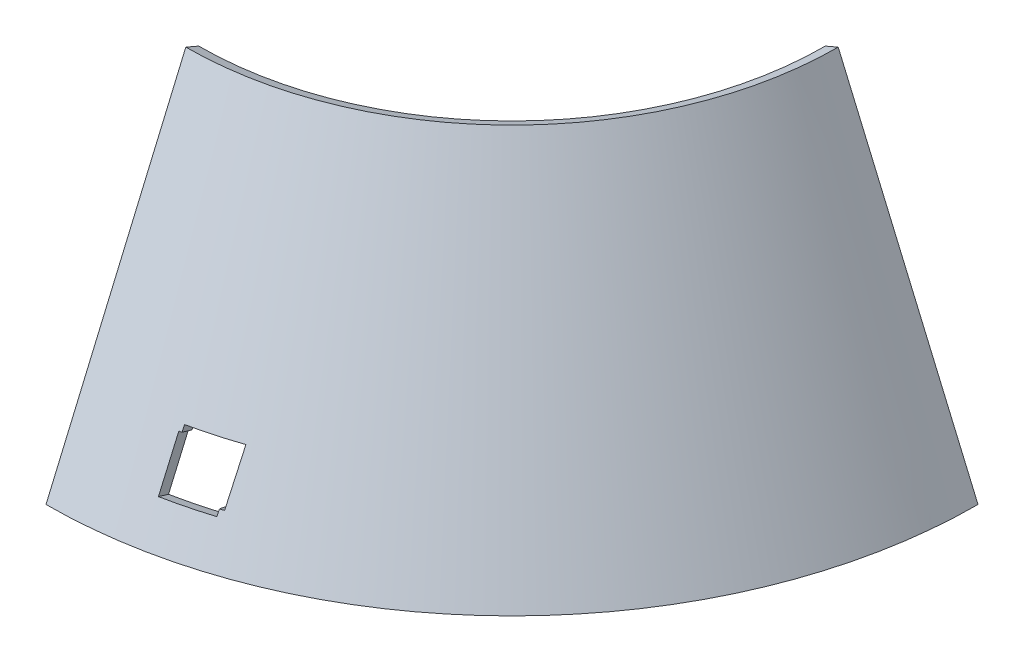
ISO-10303-21;
HEADER;
FILE_DESCRIPTION(('STEP AP214'),'2;1');
FILE_NAME('part.step','',(''),(''),'','','');
FILE_SCHEMA(('AUTOMOTIVE_DESIGN { 1 0 10303 214 1 1 1 1 }'));
ENDSEC;
DATA;
#1=APPLICATION_CONTEXT('core data for automotive mechanical design processes');
#2=APPLICATION_PROTOCOL_DEFINITION('international standard','automotive_design',2000,#1);
#3=PRODUCT_CONTEXT('',#1,'mechanical');
#4=PRODUCT('Part','Part','',(#3));
#5=PRODUCT_RELATED_PRODUCT_CATEGORY('part','',(#4));
#6=PRODUCT_DEFINITION_FORMATION('','',#4);
#7=PRODUCT_DEFINITION_CONTEXT('part definition',#1,'design');
#8=PRODUCT_DEFINITION('design','',#6,#7);
#9=PRODUCT_DEFINITION_SHAPE('','',#8);
#10=(LENGTH_UNIT() NAMED_UNIT(*) SI_UNIT(.MILLI.,.METRE.));
#11=(NAMED_UNIT(*) PLANE_ANGLE_UNIT() SI_UNIT($,.RADIAN.));
#12=(NAMED_UNIT(*) SI_UNIT($,.STERADIAN.) SOLID_ANGLE_UNIT());
#13=UNCERTAINTY_MEASURE_WITH_UNIT(LENGTH_MEASURE(1.E-05),#10,'distance_accuracy_value','');
#14=(GEOMETRIC_REPRESENTATION_CONTEXT(3) GLOBAL_UNCERTAINTY_ASSIGNED_CONTEXT((#13)) GLOBAL_UNIT_ASSIGNED_CONTEXT((#10,
#11,#12)) REPRESENTATION_CONTEXT('',''));
#15=CARTESIAN_POINT('',(0.,0.,0.));
#16=DIRECTION('',(0.,0.,1.));
#17=DIRECTION('',(1.,0.,0.));
#18=AXIS2_PLACEMENT_3D('',#15,#16,#17);
#19=CARTESIAN_POINT('',(0.,0.,0.));
#20=DIRECTION('',(0.,1.,0.));
#21=DIRECTION('',(-1.,0.,0.));
#22=AXIS2_PLACEMENT_3D('',#19,#20,#21);
#23=CONICAL_SURFACE('',#22,50.,1.16590454050981);
#24=DIRECTION('',(-0.919145030018058,-0.393919298579167,0.));
#25=VECTOR('',#24,1.);
#26=CARTESIAN_POINT('',(50.,0.,0.));
#27=LINE('',#26,#25);
#28=CARTESIAN_POINT('',(50.,0.,0.));
#29=VERTEX_POINT('',#28);
#30=CARTESIAN_POINT('',(48.6212824549729,-0.590878947868689,0.));
#31=VERTEX_POINT('',#30);
#32=EDGE_CURVE('E12',#29,#31,#27,.T.);
#33=ORIENTED_EDGE('',*,*,#32,.F.);
#34=CARTESIAN_POINT('',(0.,0.,0.));
#35=DIRECTION('',(0.,1.,0.));
#36=DIRECTION('',(-1.,0.,0.));
#37=AXIS2_PLACEMENT_3D('',#34,#35,#36);
#38=CIRCLE('',#37,50.);
#39=CARTESIAN_POINT('',(0.,0.,50.));
#40=VERTEX_POINT('',#39);
#41=EDGE_CURVE('E584',#40,#29,#38,.T.);
#42=ORIENTED_EDGE('',*,*,#41,.F.);
#43=DIRECTION('',(0.,-0.393919298579167,-0.919145030018058));
#44=VECTOR('',#43,1.);
#45=CARTESIAN_POINT('',(0.,0.,50.));
#46=LINE('',#45,#44);
#47=CARTESIAN_POINT('',(0.,-0.5908789478688,48.6212824549729));
#48=VERTEX_POINT('',#47);
#49=EDGE_CURVE('E115',#40,#48,#46,.T.);
#50=ORIENTED_EDGE('',*,*,#49,.T.);
#51=CARTESIAN_POINT('',(0.,-0.5908789478688,0.));
#52=DIRECTION('',(0.,-1.,0.));
#53=DIRECTION('',(1.,0.,0.));
#54=AXIS2_PLACEMENT_3D('',#51,#52,#53);
#55=CIRCLE('',#54,48.6212824549729);
#56=EDGE_CURVE('E582',#48,#31,#55,.F.);
#57=ORIENTED_EDGE('',*,*,#56,.T.);
#58=EDGE_LOOP('',(#33,#42,#50,#57));
#59=FACE_BOUND('',#58,.T.);
#60=ADVANCED_FACE('F105',(#59),#23,.T.);
#61=CARTESIAN_POINT('',(0.,35.,35.));
#62=DIRECTION('',(-1.,0.,0.));
#63=DIRECTION('',(0.,-0.919145030018058,0.393919298579168));
#64=AXIS2_PLACEMENT_3D('',#61,#62,#63);
#65=PLANE('',#64);
#66=ORIENTED_EDGE('',*,*,#49,.F.);
#67=DIRECTION('',(0.,-0.919145030018058,0.393919298579168));
#68=VECTOR('',#67,1.);
#69=CARTESIAN_POINT('',(0.,35.,35.));
#70=LINE('',#69,#68);
#71=CARTESIAN_POINT('',(0.,35.,35.));
#72=VERTEX_POINT('',#71);
#73=EDGE_CURVE('E595',#72,#40,#70,.T.);
#74=ORIENTED_EDGE('',*,*,#73,.F.);
#75=DIRECTION('',(0.,-0.393919298579167,-0.919145030018058));
#76=VECTOR('',#75,1.);
#77=CARTESIAN_POINT('',(0.,35.,35.));
#78=LINE('',#77,#76);
#79=CARTESIAN_POINT('',(0.,34.4091210521312,33.6212824549729));
#80=VERTEX_POINT('',#79);
#81=EDGE_CURVE('E560',#72,#80,#78,.T.);
#82=ORIENTED_EDGE('',*,*,#81,.T.);
#83=DIRECTION('',(0.,-0.919145030018058,0.393919298579167));
#84=VECTOR('',#83,1.);
#85=CARTESIAN_POINT('',(0.,-722.950151972001,358.203828036744));
#86=LINE('',#85,#84);
#87=EDGE_CURVE('E210',#80,#48,#86,.T.);
#88=ORIENTED_EDGE('',*,*,#87,.T.);
#89=EDGE_LOOP('',(#66,#74,#82,#88));
#90=FACE_BOUND('',#89,.T.);
#91=ADVANCED_FACE('F590',(#90),#65,.T.);
#92=CARTESIAN_POINT('',(0.,35.,0.));
#93=DIRECTION('',(0.,1.,0.));
#94=DIRECTION('',(-1.,0.,0.));
#95=AXIS2_PLACEMENT_3D('',#92,#93,#94);
#96=CONICAL_SURFACE('',#95,35.,1.16590454050981);
#97=ORIENTED_EDGE('',*,*,#81,.F.);
#98=CARTESIAN_POINT('',(0.,35.,0.));
#99=DIRECTION('',(0.,-1.,0.));
#100=DIRECTION('',(1.,0.,0.));
#101=AXIS2_PLACEMENT_3D('',#98,#99,#100);
#102=CIRCLE('',#101,35.);
#103=CARTESIAN_POINT('',(35.,35.,0.));
#104=VERTEX_POINT('',#103);
#105=EDGE_CURVE('E482',#104,#72,#102,.T.);
#106=ORIENTED_EDGE('',*,*,#105,.F.);
#107=DIRECTION('',(-0.919145030018058,-0.393919298579167,0.));
#108=VECTOR('',#107,1.);
#109=CARTESIAN_POINT('',(35.,35.,0.));
#110=LINE('',#109,#108);
#111=CARTESIAN_POINT('',(33.6212824549729,34.4091210521313,0.));
#112=VERTEX_POINT('',#111);
#113=EDGE_CURVE('E109',#104,#112,#110,.T.);
#114=ORIENTED_EDGE('',*,*,#113,.T.);
#115=CARTESIAN_POINT('',(0.,34.4091210521312,0.));
#116=DIRECTION('',(0.,-1.,0.));
#117=DIRECTION('',(1.,0.,0.));
#118=AXIS2_PLACEMENT_3D('',#115,#116,#117);
#119=CIRCLE('',#118,33.6212824549729);
#120=EDGE_CURVE('E475',#112,#80,#119,.T.);
#121=ORIENTED_EDGE('',*,*,#120,.T.);
#122=EDGE_LOOP('',(#97,#106,#114,#121));
#123=FACE_BOUND('',#122,.T.);
#124=ADVANCED_FACE('F430',(#123),#96,.F.);
#125=CARTESIAN_POINT('',(14.3892419399736,4.67901168580253,45.7869177279484));
#126=CARTESIAN_POINT('',(14.3893812829383,4.48205203651404,45.8753554285286));
#127=CARTESIAN_POINT('',(14.3893813113343,4.28509238722455,45.96381411015));
#128=CARTESIAN_POINT('',(14.3892419565247,4.08813273793385,46.0522934335054));
#129=CARTESIAN_POINT('',(13.9758901222228,4.08813273793378,44.4716221932006));
#130=CARTESIAN_POINT('',(13.9767524498923,3.89117308864523,44.559832684736));
#131=CARTESIAN_POINT('',(13.9774756503298,3.6942134393558,44.6480647534225));
#132=CARTESIAN_POINT('',(13.978059653915,3.49725379006509,44.7363180602608));
#133=B_SPLINE_SURFACE_WITH_KNOTS('',1,3,((#125,#126,#127,#128),(#129,#130,#131,#132)),
.UNSPECIFIED.,.F.,.F.,.F.,(2,2),(4,4),(0.,1.),(0.,1.),.UNSPECIFIED.);
#134=CARTESIAN_POINT('',(13.978059653915,3.49725379006509,44.7363180602608));
#135=CARTESIAN_POINT('',(14.3892419565247,4.08813273793385,46.0522934335054));
#136=B_SPLINE_CURVE_WITH_KNOTS('',1,(#134,#135),.UNSPECIFIED.,.F.,.F.,(2,2),(0.,1.),.UNSPECIFIED.);
#137=CARTESIAN_POINT('',(14.3892419565247,4.08813273793385,46.0522934335054));
#138=VERTEX_POINT('',#137);
#139=CARTESIAN_POINT('',(13.978059653915,3.49725379006507,44.7363180602608));
#140=VERTEX_POINT('',#139);
#141=EDGE_CURVE('E177',#138,#140,#136,.F.);
#142=CARTESIAN_POINT('',(14.3892419565247,4.08813273793385,46.0522934335054));
#143=CARTESIAN_POINT('',(14.3893813113343,4.28509238722455,45.96381411015));
#144=CARTESIAN_POINT('',(14.3893812829383,4.48205203651404,45.8753554285286));
#145=CARTESIAN_POINT('',(14.3892419399736,4.67901168580253,45.7869177279484));
#146=B_SPLINE_CURVE_WITH_KNOTS('',3,(#142,#143,#144,#145),.UNSPECIFIED.,.F.,.F.,(4,4),(0.,1.),.UNSPECIFIED.);
#147=CARTESIAN_POINT('',(14.3892419399736,4.6790116858026,45.7869177279484));
#148=VERTEX_POINT('',#147);
#149=EDGE_CURVE('E201',#148,#138,#146,.F.);
#150=CARTESIAN_POINT('',(14.3892419399736,4.67901168580253,45.7869177279484));
#151=CARTESIAN_POINT('',(13.9758901222228,4.08813273793378,44.4716221932006));
#152=B_SPLINE_CURVE_WITH_KNOTS('',1,(#150,#151),.UNSPECIFIED.,.F.,.F.,(2,2),(0.,1.),.UNSPECIFIED.);
#153=CARTESIAN_POINT('',(13.9758901222228,4.08813273793383,44.4716221932005));
#154=VERTEX_POINT('',#153);
#155=EDGE_CURVE('E413',#148,#154,#152,.T.);
#156=CARTESIAN_POINT('',(13.9758901222228,4.08813273793378,44.4716221932006));
#157=CARTESIAN_POINT('',(13.9767524498923,3.89117308864523,44.559832684736));
#158=CARTESIAN_POINT('',(13.9774756503298,3.6942134393558,44.6480647534225));
#159=CARTESIAN_POINT('',(13.978059653915,3.49725379006509,44.7363180602608));
#160=B_SPLINE_CURVE_WITH_KNOTS('',3,(#156,#157,#158,#159),.UNSPECIFIED.,.F.,.F.,(4,4),(0.,1.),.UNSPECIFIED.);
#161=EDGE_CURVE('E524',#154,#140,#160,.T.);
#162=ORIENTED_EDGE('',*,*,#141,.F.);
#163=ORIENTED_EDGE('',*,*,#149,.F.);
#164=ORIENTED_EDGE('',*,*,#155,.T.);
#165=ORIENTED_EDGE('',*,*,#161,.T.);
#166=EDGE_LOOP('',(#162,#163,#164,#165));
#167=FACE_BOUND('',#166,.T.);
#168=ADVANCED_FACE('F419',(#167),#133,.T.);
#169=CARTESIAN_POINT('',(0.,4.67901168580261,0.));
#170=DIRECTION('',(0.,1.,0.));
#171=DIRECTION('',(-1.,0.,0.));
#172=AXIS2_PLACEMENT_3D('',#169,#170,#171);
#173=CONICAL_SURFACE('',#172,47.9947092775132,1.16590454050981);
#174=ORIENTED_EDGE('',*,*,#155,.F.);
#175=CARTESIAN_POINT('',(0.,4.67901168580261,0.));
#176=DIRECTION('',(0.,-1.,0.));
#177=DIRECTION('',(1.,0.,0.));
#178=AXIS2_PLACEMENT_3D('',#175,#176,#177);
#179=CIRCLE('',#178,47.9947092775132);
#180=CARTESIAN_POINT('',(14.8148190944937,4.67901168580253,45.650994007036));
#181=VERTEX_POINT('',#180);
#182=EDGE_CURVE('E326',#181,#148,#179,.T.);
#183=ORIENTED_EDGE('',*,*,#182,.F.);
#184=CARTESIAN_POINT('',(14.3892419565247,4.08813273793378,44.3396030780588));
#185=CARTESIAN_POINT('',(14.8148190944937,4.67901168580253,45.650994007036));
#186=B_SPLINE_CURVE_WITH_KNOTS('',1,(#184,#185),.UNSPECIFIED.,.F.,.F.,(2,2),(0.,1.),.UNSPECIFIED.);
#187=CARTESIAN_POINT('',(14.3892419565247,4.08813273793378,44.3396030780588));
#188=VERTEX_POINT('',#187);
#189=EDGE_CURVE('E393',#181,#188,#186,.F.);
#190=ORIENTED_EDGE('',*,*,#189,.T.);
#191=CARTESIAN_POINT('',(0.,4.08813273793374,0.));
#192=DIRECTION('',(0.,-1.,0.));
#193=DIRECTION('',(1.,0.,0.));
#194=AXIS2_PLACEMENT_3D('',#191,#192,#193);
#195=CIRCLE('',#194,46.6159917324861);
#196=EDGE_CURVE('E518',#188,#154,#195,.T.);
#197=ORIENTED_EDGE('',*,*,#196,.T.);
#198=EDGE_LOOP('',(#174,#183,#190,#197));
#199=FACE_BOUND('',#198,.T.);
#200=ADVANCED_FACE('F351',(#199),#173,.F.);
#201=CARTESIAN_POINT('',(14.8353247552336,9.67901168580254,43.3855446385673));
#202=CARTESIAN_POINT('',(14.8397114872505,8.01234502431153,44.1389348409915));
#203=CARTESIAN_POINT('',(14.8328944856538,6.34567836530088,44.8941710754929));
#204=CARTESIAN_POINT('',(14.8148190944937,4.67901168580253,45.650994007036));
#205=CARTESIAN_POINT('',(14.3892419565247,9.08813273793379,42.0809863969922));
#206=CARTESIAN_POINT('',(14.4004459159958,7.42146607618486,42.8320455055236));
#207=CARTESIAN_POINT('',(14.4004644145953,5.75479941717914,43.5850040842722));
#208=CARTESIAN_POINT('',(14.3892419565247,4.08813273793378,44.3396030780588));
#209=B_SPLINE_SURFACE_WITH_KNOTS('',1,3,((#201,#202,#203,#204),(#205,#206,#207,#208)),
.UNSPECIFIED.,.F.,.F.,.F.,(2,2),(4,4),(0.,1.),(0.,1.),.UNSPECIFIED.);
#210=CARTESIAN_POINT('',(14.8148190944937,4.67901168580253,45.650994007036));
#211=CARTESIAN_POINT('',(14.8328944856538,6.34567836530088,44.8941710754929));
#212=CARTESIAN_POINT('',(14.8397114872505,8.01234502431153,44.1389348409915));
#213=CARTESIAN_POINT('',(14.8353247552336,9.67901168580254,43.3855446385673));
#214=B_SPLINE_CURVE_WITH_KNOTS('',3,(#210,#211,#212,#213),.UNSPECIFIED.,.F.,.F.,(4,4),(0.,1.),.UNSPECIFIED.);
#215=CARTESIAN_POINT('',(14.8353247552336,9.67901168580252,43.3855446385672));
#216=VERTEX_POINT('',#215);
#217=EDGE_CURVE('E322',#216,#181,#214,.F.);
#218=CARTESIAN_POINT('',(14.8353247552336,9.67901168580254,43.3855446385673));
#219=CARTESIAN_POINT('',(14.3892419565247,9.08813273793379,42.0809863969922));
#220=B_SPLINE_CURVE_WITH_KNOTS('',1,(#218,#219),.UNSPECIFIED.,.F.,.F.,(2,2),(0.,1.),.UNSPECIFIED.);
#221=CARTESIAN_POINT('',(14.3892419565247,9.08813273793379,42.0809863969922));
#222=VERTEX_POINT('',#221);
#223=EDGE_CURVE('E380',#216,#222,#220,.T.);
#224=CARTESIAN_POINT('',(14.3892419565247,9.08813273793379,42.0809863969922));
#225=CARTESIAN_POINT('',(14.4004459159958,7.42146607618486,42.8320455055236));
#226=CARTESIAN_POINT('',(14.4004644145953,5.75479941717914,43.5850040842722));
#227=CARTESIAN_POINT('',(14.3892419565247,4.08813273793378,44.3396030780588));
#228=B_SPLINE_CURVE_WITH_KNOTS('',3,(#224,#225,#226,#227),.UNSPECIFIED.,.F.,.F.,(4,4),(0.,1.),.UNSPECIFIED.);
#229=EDGE_CURVE('E335',#222,#188,#228,.T.);
#230=ORIENTED_EDGE('',*,*,#189,.F.);
#231=ORIENTED_EDGE('',*,*,#217,.F.);
#232=ORIENTED_EDGE('',*,*,#223,.T.);
#233=ORIENTED_EDGE('',*,*,#229,.T.);
#234=EDGE_LOOP('',(#230,#231,#232,#233));
#235=FACE_BOUND('',#234,.T.);
#236=ADVANCED_FACE('F340',(#235),#209,.T.);
#237=CARTESIAN_POINT('',(0.,9.67901168580252,0.));
#238=DIRECTION('',(0.,1.,0.));
#239=DIRECTION('',(-1.,0.,0.));
#240=AXIS2_PLACEMENT_3D('',#237,#238,#239);
#241=CONICAL_SURFACE('',#240,45.851852134656,1.16590454050981);
#242=ORIENTED_EDGE('',*,*,#223,.F.);
#243=CARTESIAN_POINT('',(0.,9.67901168580252,0.));
#244=DIRECTION('',(0.,1.,0.));
#245=DIRECTION('',(-1.,0.,0.));
#246=AXIS2_PLACEMENT_3D('',#243,#244,#245);
#247=CIRCLE('',#246,45.851852134656);
#248=CARTESIAN_POINT('',(9.6803190919552,9.67901168580254,44.8183418530438));
#249=VERTEX_POINT('',#248);
#250=EDGE_CURVE('E533',#249,#216,#247,.T.);
#251=ORIENTED_EDGE('',*,*,#250,.F.);
#252=CARTESIAN_POINT('',(9.38924195652468,9.08813273793379,43.470700888174));
#253=CARTESIAN_POINT('',(9.6803190919552,9.67901168580254,44.8183418530438));
#254=B_SPLINE_CURVE_WITH_KNOTS('',1,(#252,#253),.UNSPECIFIED.,.F.,.F.,(2,2),(0.,1.),.UNSPECIFIED.);
#255=CARTESIAN_POINT('',(9.38924195652467,9.08813273793377,43.470700888174));
#256=VERTEX_POINT('',#255);
#257=EDGE_CURVE('E537',#249,#256,#254,.F.);
#258=ORIENTED_EDGE('',*,*,#257,.T.);
#259=CARTESIAN_POINT('',(0.,9.08813273793374,0.));
#260=DIRECTION('',(0.,-1.,0.));
#261=DIRECTION('',(1.,0.,0.));
#262=AXIS2_PLACEMENT_3D('',#259,#260,#261);
#263=CIRCLE('',#262,44.4731345896289);
#264=EDGE_CURVE('E525',#256,#222,#263,.F.);
#265=ORIENTED_EDGE('',*,*,#264,.T.);
#266=EDGE_LOOP('',(#242,#251,#258,#265));
#267=FACE_BOUND('',#266,.T.);
#268=ADVANCED_FACE('F280',(#267),#241,.T.);
#269=CARTESIAN_POINT('',(9.67867111491649,9.08813273793707,45.0777359424824));
#270=CARTESIAN_POINT('',(9.67932375686931,9.28509238722589,44.9912607487622));
#271=CARTESIAN_POINT('',(9.67987307382953,9.4820520365144,44.9047959896124));
#272=CARTESIAN_POINT('',(9.6803190919552,9.67901168580254,44.8183418530438));
#273=CARTESIAN_POINT('',(9.38924201185565,8.49725379006832,43.7297400733244));
#274=CARTESIAN_POINT('',(9.38934523742772,8.69421343935713,43.6433828451663));
#275=CARTESIAN_POINT('',(9.38934521012782,8.89117308864564,43.5570363874753));
#276=CARTESIAN_POINT('',(9.38924195652468,9.08813273793379,43.470700888174));
#277=B_SPLINE_SURFACE_WITH_KNOTS('',1,3,((#269,#270,#271,#272),(#273,#274,#275,#276)),
.UNSPECIFIED.,.F.,.F.,.F.,(2,2),(4,4),(0.,1.),(0.,1.),.UNSPECIFIED.);
#278=CARTESIAN_POINT('',(9.6803190919552,9.67901168580254,44.8183418530438));
#279=CARTESIAN_POINT('',(9.67987307382953,9.4820520365144,44.9047959896124));
#280=CARTESIAN_POINT('',(9.67932375686931,9.28509238722589,44.9912607487622));
#281=CARTESIAN_POINT('',(9.67867111491649,9.08813273793707,45.0777359424824));
#282=B_SPLINE_CURVE_WITH_KNOTS('',3,(#278,#279,#280,#281),.UNSPECIFIED.,.F.,.F.,(4,4),(0.,1.),.UNSPECIFIED.);
#283=CARTESIAN_POINT('',(9.67867111491662,9.08813273793381,45.077735942483));
#284=VERTEX_POINT('',#283);
#285=EDGE_CURVE('E481',#284,#249,#282,.F.);
#286=CARTESIAN_POINT('',(9.67867111491649,9.08813273793707,45.0777359424824));
#287=CARTESIAN_POINT('',(9.38924201185565,8.49725379006832,43.7297400733244));
#288=B_SPLINE_CURVE_WITH_KNOTS('',1,(#286,#287),.UNSPECIFIED.,.F.,.F.,(2,2),(0.,1.),.UNSPECIFIED.);
#289=CARTESIAN_POINT('',(9.3892420118559,8.4972537900653,43.7297400733256));
#290=VERTEX_POINT('',#289);
#291=EDGE_CURVE('E263',#284,#290,#288,.T.);
#292=CARTESIAN_POINT('',(9.38924201185565,8.49725379006832,43.7297400733244));
#293=CARTESIAN_POINT('',(9.38934523742772,8.69421343935713,43.6433828451663));
#294=CARTESIAN_POINT('',(9.38934521012782,8.89117308864564,43.5570363874753));
#295=CARTESIAN_POINT('',(9.38924195652468,9.08813273793379,43.470700888174));
#296=B_SPLINE_CURVE_WITH_KNOTS('',3,(#292,#293,#294,#295),.UNSPECIFIED.,.F.,.F.,(4,4),(0.,1.),.UNSPECIFIED.);
#297=EDGE_CURVE('E474',#290,#256,#296,.T.);
#298=ORIENTED_EDGE('',*,*,#257,.F.);
#299=ORIENTED_EDGE('',*,*,#285,.F.);
#300=ORIENTED_EDGE('',*,*,#291,.T.);
#301=ORIENTED_EDGE('',*,*,#297,.T.);
#302=EDGE_LOOP('',(#298,#299,#300,#301));
#303=FACE_BOUND('',#302,.T.);
#304=ADVANCED_FACE('F269',(#303),#277,.T.);
#305=CARTESIAN_POINT('',(0.,9.08813273793381,0.));
#306=DIRECTION('',(0.,1.,0.));
#307=DIRECTION('',(-1.,0.,0.));
#308=AXIS2_PLACEMENT_3D('',#305,#306,#307);
#309=CONICAL_SURFACE('',#308,46.1050859694562,1.16590454050981);
#310=ORIENTED_EDGE('',*,*,#291,.F.);
#311=CARTESIAN_POINT('',(0.,9.08813273793381,0.));
#312=DIRECTION('',(0.,1.,0.));
#313=DIRECTION('',(-1.,0.,0.));
#314=AXIS2_PLACEMENT_3D('',#311,#312,#313);
#315=CIRCLE('',#314,46.1050859694562);
#316=CARTESIAN_POINT('',(9.38924195652453,9.08813273793381,45.1389088008648));
#317=VERTEX_POINT('',#316);
#318=EDGE_CURVE('E467',#317,#284,#315,.T.);
#319=ORIENTED_EDGE('',*,*,#318,.F.);
#320=CARTESIAN_POINT('',(9.10846788685824,8.4972537900651,43.7890836304199));
#321=CARTESIAN_POINT('',(9.38924195652467,9.08813273793385,45.1389088008655));
#322=B_SPLINE_CURVE_WITH_KNOTS('',1,(#320,#321),.UNSPECIFIED.,.F.,.F.,(2,2),(0.,1.),.UNSPECIFIED.);
#323=CARTESIAN_POINT('',(9.10846788685821,8.4972537900653,43.7890836304197));
#324=VERTEX_POINT('',#323);
#325=EDGE_CURVE('E189',#317,#324,#322,.F.);
#326=ORIENTED_EDGE('',*,*,#325,.T.);
#327=CARTESIAN_POINT('',(0.,8.49725379006505,0.));
#328=DIRECTION('',(0.,-1.,0.));
#329=DIRECTION('',(1.,0.,0.));
#330=AXIS2_PLACEMENT_3D('',#327,#328,#329);
#331=CIRCLE('',#330,44.7263684244298);
#332=EDGE_CURVE('E466',#324,#290,#331,.F.);
#333=ORIENTED_EDGE('',*,*,#332,.T.);
#334=EDGE_LOOP('',(#310,#319,#326,#333));
#335=FACE_BOUND('',#334,.T.);
#336=ADVANCED_FACE('F234',(#335),#309,.T.);
#337=CARTESIAN_POINT('',(9.38924195652465,4.08813273793385,47.3255338062967));
#338=CARTESIAN_POINT('',(9.39583785651608,5.75479940616425,46.5960175332552));
#339=CARTESIAN_POINT('',(9.39583381772453,7.42146607190442,45.867112307436));
#340=CARTESIAN_POINT('',(9.38924195652467,9.08813273793385,45.1389088008655));
#341=CARTESIAN_POINT('',(9.12093802924985,3.49725379006509,45.9731747298771));
#342=CARTESIAN_POINT('',(9.12337334678707,5.16392045826383,45.244483903753));
#343=CARTESIAN_POINT('',(9.11921253485203,6.83058712400379,44.51642332525));
#344=CARTESIAN_POINT('',(9.10846788685824,8.4972537900651,43.7890836304199));
#345=B_SPLINE_SURFACE_WITH_KNOTS('',1,3,((#337,#338,#339,#340),(#341,#342,#343,#344)),
.UNSPECIFIED.,.F.,.F.,.F.,(2,2),(4,4),(0.,1.),(0.,1.),.UNSPECIFIED.);
#346=CARTESIAN_POINT('',(9.38924195652467,9.08813273793385,45.1389088008655));
#347=CARTESIAN_POINT('',(9.39583381772453,7.42146607190442,45.867112307436));
#348=CARTESIAN_POINT('',(9.39583785651608,5.75479940616425,46.5960175332552));
#349=CARTESIAN_POINT('',(9.38924195652465,4.08813273793385,47.3255338062967));
#350=B_SPLINE_CURVE_WITH_KNOTS('',3,(#346,#347,#348,#349),.UNSPECIFIED.,.F.,.F.,(4,4),(0.,1.),.UNSPECIFIED.);
#351=CARTESIAN_POINT('',(9.38924195652465,4.08813273793383,47.3255338062967));
#352=VERTEX_POINT('',#351);
#353=EDGE_CURVE('E198',#352,#317,#350,.F.);
#354=CARTESIAN_POINT('',(9.38924195652465,4.08813273793385,47.3255338062967));
#355=CARTESIAN_POINT('',(9.12093802924985,3.49725379006509,45.9731747298771));
#356=B_SPLINE_CURVE_WITH_KNOTS('',1,(#354,#355),.UNSPECIFIED.,.F.,.F.,(2,2),(0.,1.),.UNSPECIFIED.);
#357=CARTESIAN_POINT('',(9.12093802924984,3.49725379006506,45.973174729877));
#358=VERTEX_POINT('',#357);
#359=EDGE_CURVE('E123',#352,#358,#356,.T.);
#360=CARTESIAN_POINT('',(9.12093802924985,3.49725379006509,45.9731747298771));
#361=CARTESIAN_POINT('',(9.12337334678707,5.16392045826383,45.244483903753));
#362=CARTESIAN_POINT('',(9.11921253485203,6.83058712400379,44.51642332525));
#363=CARTESIAN_POINT('',(9.10846788685824,8.4972537900651,43.7890836304199));
#364=B_SPLINE_CURVE_WITH_KNOTS('',3,(#360,#361,#362,#363),.UNSPECIFIED.,.F.,.F.,(4,4),(0.,1.),.UNSPECIFIED.);
#365=EDGE_CURVE('E190',#358,#324,#364,.T.);
#366=ORIENTED_EDGE('',*,*,#325,.F.);
#367=ORIENTED_EDGE('',*,*,#353,.F.);
#368=ORIENTED_EDGE('',*,*,#359,.T.);
#369=ORIENTED_EDGE('',*,*,#365,.T.);
#370=EDGE_LOOP('',(#366,#367,#368,#369));
#371=FACE_BOUND('',#370,.T.);
#372=ADVANCED_FACE('F205',(#371),#345,.T.);
#373=CARTESIAN_POINT('',(50.,0.,0.));
#374=DIRECTION('',(0.,0.,-1.));
#375=DIRECTION('',(-0.393919298579166,0.919145030018058,0.));
#376=AXIS2_PLACEMENT_3D('',#373,#374,#375);
#377=PLANE('',#376);
#378=DIRECTION('',(-0.393919298579166,0.919145030018058,0.));
#379=VECTOR('',#378,1.);
#380=CARTESIAN_POINT('',(50.,0.,0.));
#381=LINE('',#380,#379);
#382=EDGE_CURVE('E597',#29,#104,#381,.T.);
#383=ORIENTED_EDGE('',*,*,#382,.F.);
#384=ORIENTED_EDGE('',*,*,#32,.T.);
#385=DIRECTION('',(0.393919298579167,-0.919145030018058,0.));
#386=VECTOR('',#385,1.);
#387=CARTESIAN_POINT('',(358.203828036744,-722.950151972001,1.95043527147125E-13));
#388=LINE('',#387,#386);
#389=EDGE_CURVE('E588',#31,#112,#388,.F.);
#390=ORIENTED_EDGE('',*,*,#389,.T.);
#391=ORIENTED_EDGE('',*,*,#113,.F.);
#392=EDGE_LOOP('',(#383,#384,#390,#391));
#393=FACE_BOUND('',#392,.T.);
#394=ADVANCED_FACE('F107',(#393),#377,.T.);
#395=CARTESIAN_POINT('',(0.,4.08813273793383,0.));
#396=DIRECTION('',(0.,1.,0.));
#397=DIRECTION('',(-1.,0.,0.));
#398=AXIS2_PLACEMENT_3D('',#395,#396,#397);
#399=CONICAL_SURFACE('',#398,48.2479431123141,1.16590454050981);
#400=CARTESIAN_POINT('',(0.,4.08813273793383,0.));
#401=DIRECTION('',(0.,-1.,0.));
#402=DIRECTION('',(1.,0.,0.));
#403=AXIS2_PLACEMENT_3D('',#400,#401,#402);
#404=CIRCLE('',#403,48.2479431123141);
#405=EDGE_CURVE('E185',#138,#352,#404,.T.);
#406=ORIENTED_EDGE('',*,*,#405,.F.);
#407=ORIENTED_EDGE('',*,*,#141,.T.);
#408=CARTESIAN_POINT('',(0.,3.49725379006505,0.));
#409=DIRECTION('',(0.,-1.,0.));
#410=DIRECTION('',(1.,0.,0.));
#411=AXIS2_PLACEMENT_3D('',#408,#409,#410);
#412=CIRCLE('',#411,46.869225567287);
#413=EDGE_CURVE('E187',#140,#358,#412,.T.);
#414=ORIENTED_EDGE('',*,*,#413,.T.);
#415=ORIENTED_EDGE('',*,*,#359,.F.);
#416=EDGE_LOOP('',(#406,#407,#414,#415));
#417=FACE_BOUND('',#416,.T.);
#418=ADVANCED_FACE('F184',(#417),#399,.F.);
#419=CARTESIAN_POINT('',(-1.26217592278436E-13,-722.950151972001,0.));
#420=DIRECTION('',(0.,-1.,0.));
#421=DIRECTION('',(1.,0.,0.));
#422=AXIS2_PLACEMENT_3D('',#419,#420,#421);
#423=CONICAL_SURFACE('',#422,358.203828036744,0.404891786285083);
#424=ORIENTED_EDGE('',*,*,#365,.F.);
#425=ORIENTED_EDGE('',*,*,#413,.F.);
#426=ORIENTED_EDGE('',*,*,#161,.F.);
#427=ORIENTED_EDGE('',*,*,#196,.F.);
#428=ORIENTED_EDGE('',*,*,#229,.F.);
#429=ORIENTED_EDGE('',*,*,#264,.F.);
#430=ORIENTED_EDGE('',*,*,#297,.F.);
#431=ORIENTED_EDGE('',*,*,#332,.F.);
#432=EDGE_LOOP('',(#424,#425,#426,#427,#428,#429,#430,#431));
#433=FACE_BOUND('',#432,.T.);
#434=ORIENTED_EDGE('',*,*,#120,.F.);
#435=ORIENTED_EDGE('',*,*,#389,.F.);
#436=ORIENTED_EDGE('',*,*,#56,.F.);
#437=ORIENTED_EDGE('',*,*,#87,.F.);
#438=EDGE_LOOP('',(#434,#435,#436,#437));
#439=FACE_BOUND('',#438,.T.);
#440=ADVANCED_FACE('F470',(#433,#439),#423,.F.);
#441=CARTESIAN_POINT('',(-1.26128564975262E-13,-722.359273024132,0.));
#442=DIRECTION('',(0.,-1.,0.));
#443=DIRECTION('',(1.,0.,0.));
#444=AXIS2_PLACEMENT_3D('',#441,#442,#443);
#445=CONICAL_SURFACE('',#444,359.582545581771,0.404891786285083);
#446=ORIENTED_EDGE('',*,*,#353,.T.);
#447=ORIENTED_EDGE('',*,*,#318,.T.);
#448=ORIENTED_EDGE('',*,*,#285,.T.);
#449=ORIENTED_EDGE('',*,*,#250,.T.);
#450=ORIENTED_EDGE('',*,*,#217,.T.);
#451=ORIENTED_EDGE('',*,*,#182,.T.);
#452=ORIENTED_EDGE('',*,*,#149,.T.);
#453=ORIENTED_EDGE('',*,*,#405,.T.);
#454=EDGE_LOOP('',(#446,#447,#448,#449,#450,#451,#452,#453));
#455=FACE_BOUND('',#454,.T.);
#456=ORIENTED_EDGE('',*,*,#105,.T.);
#457=ORIENTED_EDGE('',*,*,#73,.T.);
#458=ORIENTED_EDGE('',*,*,#41,.T.);
#459=ORIENTED_EDGE('',*,*,#382,.T.);
#460=EDGE_LOOP('',(#456,#457,#458,#459));
#461=FACE_BOUND('',#460,.T.);
#462=ADVANCED_FACE('F195',(#455,#461),#445,.T.);
#463=CLOSED_SHELL('',(#60,#91,#124,#168,#200,#236,#268,#304,#336,#372,#394,#418,#440,#462));
#464=MANIFOLD_SOLID_BREP('B2',#463);
#465=ADVANCED_BREP_SHAPE_REPRESENTATION('',(#18,#464),#14);
#466=SHAPE_DEFINITION_REPRESENTATION(#9,#465);
ENDSEC;
END-ISO-10303-21;
